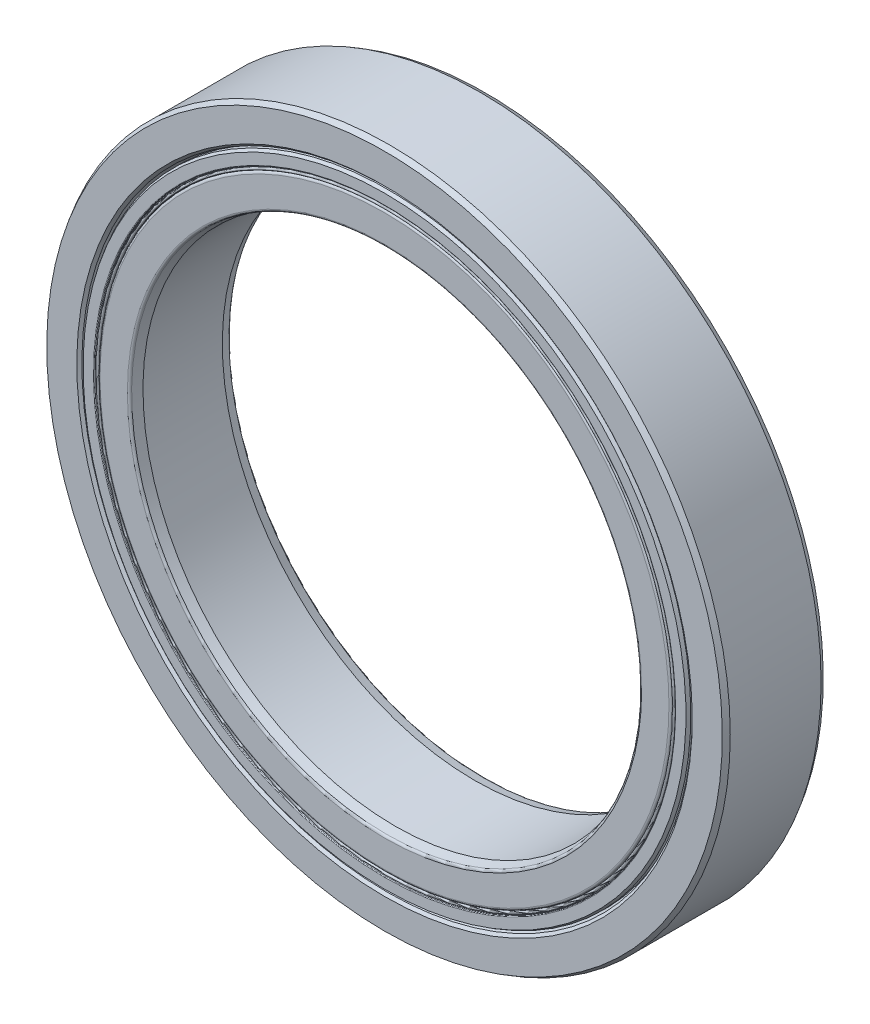
ISO-10303-21;
HEADER;
FILE_DESCRIPTION(('STEP AP214'),'2;1');
FILE_NAME('part.step','',(''),(''),'','','');
FILE_SCHEMA(('AUTOMOTIVE_DESIGN { 1 0 10303 214 1 1 1 1 }'));
ENDSEC;
DATA;
#1=APPLICATION_CONTEXT('core data for automotive mechanical design processes');
#2=APPLICATION_PROTOCOL_DEFINITION('international standard','automotive_design',2000,#1);
#3=PRODUCT_CONTEXT('',#1,'mechanical');
#4=PRODUCT('Part','Part','',(#3));
#5=PRODUCT_RELATED_PRODUCT_CATEGORY('part','',(#4));
#6=PRODUCT_DEFINITION_FORMATION('','',#4);
#7=PRODUCT_DEFINITION_CONTEXT('part definition',#1,'design');
#8=PRODUCT_DEFINITION('design','',#6,#7);
#9=PRODUCT_DEFINITION_SHAPE('','',#8);
#10=(LENGTH_UNIT() NAMED_UNIT(*) SI_UNIT(.MILLI.,.METRE.));
#11=(NAMED_UNIT(*) PLANE_ANGLE_UNIT() SI_UNIT($,.RADIAN.));
#12=(NAMED_UNIT(*) SI_UNIT($,.STERADIAN.) SOLID_ANGLE_UNIT());
#13=UNCERTAINTY_MEASURE_WITH_UNIT(LENGTH_MEASURE(1.E-05),#10,'distance_accuracy_value','');
#14=(GEOMETRIC_REPRESENTATION_CONTEXT(3) GLOBAL_UNCERTAINTY_ASSIGNED_CONTEXT((#13)) GLOBAL_UNIT_ASSIGNED_CONTEXT((#10,
#11,#12)) REPRESENTATION_CONTEXT('',''));
#15=CARTESIAN_POINT('',(0.,0.,0.));
#16=DIRECTION('',(0.,0.,1.));
#17=DIRECTION('',(1.,0.,0.));
#18=AXIS2_PLACEMENT_3D('',#15,#16,#17);
#19=CARTESIAN_POINT('',(0.,11.37,1.3125));
#20=DIRECTION('',(0.,0.,1.));
#21=DIRECTION('',(0.,-1.,0.));
#22=AXIS2_PLACEMENT_3D('',#19,#20,#21);
#23=PLANE('',#22);
#24=CARTESIAN_POINT('',(0.,0.,1.3125));
#25=DIRECTION('',(0.,0.,1.));
#26=DIRECTION('',(0.,-1.,0.));
#27=AXIS2_PLACEMENT_3D('',#24,#25,#26);
#28=CIRCLE('',#27,11.51);
#29=CARTESIAN_POINT('',(0.,-11.51,1.31249999999999));
#30=VERTEX_POINT('',#29);
#31=EDGE_CURVE('E11',#30,#30,#28,.T.);
#32=ORIENTED_EDGE('',*,*,#31,.F.);
#33=EDGE_LOOP('',(#32));
#34=FACE_BOUND('',#33,.T.);
#35=CARTESIAN_POINT('',(0.,0.,1.3125));
#36=DIRECTION('',(0.,0.,1.));
#37=DIRECTION('',(0.,-1.,0.));
#38=AXIS2_PLACEMENT_3D('',#35,#36,#37);
#39=CIRCLE('',#38,11.37);
#40=CARTESIAN_POINT('',(0.,-11.37,1.31249999999999));
#41=VERTEX_POINT('',#40);
#42=EDGE_CURVE('E71',#41,#41,#39,.T.);
#43=ORIENTED_EDGE('',*,*,#42,.T.);
#44=EDGE_LOOP('',(#43));
#45=FACE_BOUND('',#44,.T.);
#46=ADVANCED_FACE('F46',(#34,#45),#23,.F.);
#47=CARTESIAN_POINT('',(0.,0.,2.));
#48=DIRECTION('',(0.,0.,1.));
#49=DIRECTION('',(0.,-1.,0.));
#50=AXIS2_PLACEMENT_3D('',#47,#48,#49);
#51=CYLINDRICAL_SURFACE('',#50,11.51);
#52=CARTESIAN_POINT('',(0.,0.,1.89056210322341));
#53=DIRECTION('',(0.,0.,1.));
#54=DIRECTION('',(0.,-1.,0.));
#55=AXIS2_PLACEMENT_3D('',#52,#53,#54);
#56=CIRCLE('',#55,11.51);
#57=CARTESIAN_POINT('',(0.,-11.51,1.89056210322341));
#58=VERTEX_POINT('',#57);
#59=EDGE_CURVE('E52',#58,#58,#56,.T.);
#60=ORIENTED_EDGE('',*,*,#59,.F.);
#61=EDGE_LOOP('',(#60));
#62=FACE_BOUND('',#61,.T.);
#63=ORIENTED_EDGE('',*,*,#31,.T.);
#64=EDGE_LOOP('',(#63));
#65=FACE_BOUND('',#64,.T.);
#66=ADVANCED_FACE('F102',(#62,#65),#51,.T.);
#67=CARTESIAN_POINT('',(0.,0.,1.89056210322341));
#68=DIRECTION('',(0.,0.,-1.));
#69=DIRECTION('',(0.,1.,0.));
#70=AXIS2_PLACEMENT_3D('',#67,#68,#69);
#71=CONICAL_SURFACE('',#70,11.51,0.174532925199437);
#72=CARTESIAN_POINT('',(0.,0.,1.92503037457884));
#73=DIRECTION('',(0.,0.,1.));
#74=DIRECTION('',(0.,-1.,0.));
#75=AXIS2_PLACEMENT_3D('',#72,#73,#74);
#76=CIRCLE('',#75,11.5039223137817);
#77=CARTESIAN_POINT('',(0.,-11.5039223137817,1.92503037457883));
#78=VERTEX_POINT('',#77);
#79=EDGE_CURVE('E56',#78,#78,#76,.T.);
#80=ORIENTED_EDGE('',*,*,#79,.F.);
#81=EDGE_LOOP('',(#80));
#82=FACE_BOUND('',#81,.T.);
#83=ORIENTED_EDGE('',*,*,#59,.T.);
#84=EDGE_LOOP('',(#83));
#85=FACE_BOUND('',#84,.T.);
#86=ADVANCED_FACE('F97',(#82,#85),#71,.T.);
#87=CARTESIAN_POINT('',(0.,0.,1.9225));
#88=DIRECTION('',(0.,0.,1.));
#89=DIRECTION('',(0.,-1.,0.));
#90=AXIS2_PLACEMENT_3D('',#87,#88,#89);
#91=TOROIDAL_SURFACE('',#90,11.4895718464359,0.0145718464358908);
#92=CARTESIAN_POINT('',(0.,0.,1.9225));
#93=DIRECTION('',(0.,0.,1.));
#94=DIRECTION('',(0.,-1.,0.));
#95=AXIS2_PLACEMENT_3D('',#92,#93,#94);
#96=CIRCLE('',#95,11.475);
#97=CARTESIAN_POINT('',(0.,-11.475,1.9225));
#98=VERTEX_POINT('',#97);
#99=EDGE_CURVE('E60',#98,#98,#96,.T.);
#100=ORIENTED_EDGE('',*,*,#99,.F.);
#101=EDGE_LOOP('',(#100));
#102=FACE_BOUND('',#101,.T.);
#103=ORIENTED_EDGE('',*,*,#79,.T.);
#104=EDGE_LOOP('',(#103));
#105=FACE_BOUND('',#104,.T.);
#106=ADVANCED_FACE('F91',(#102,#105),#91,.T.);
#107=CARTESIAN_POINT('',(0.,0.,2.));
#108=DIRECTION('',(0.,0.,1.));
#109=DIRECTION('',(0.,-1.,0.));
#110=AXIS2_PLACEMENT_3D('',#107,#108,#109);
#111=CYLINDRICAL_SURFACE('',#110,11.475);
#112=CARTESIAN_POINT('',(0.,0.,1.9475));
#113=DIRECTION('',(0.,0.,1.));
#114=DIRECTION('',(0.,-1.,0.));
#115=AXIS2_PLACEMENT_3D('',#112,#113,#114);
#116=CIRCLE('',#115,11.475);
#117=CARTESIAN_POINT('',(0.,-11.475,1.9475));
#118=VERTEX_POINT('',#117);
#119=EDGE_CURVE('E65',#118,#118,#116,.T.);
#120=ORIENTED_EDGE('',*,*,#119,.F.);
#121=EDGE_LOOP('',(#120));
#122=FACE_BOUND('',#121,.T.);
#123=ORIENTED_EDGE('',*,*,#99,.T.);
#124=EDGE_LOOP('',(#123));
#125=FACE_BOUND('',#124,.T.);
#126=ADVANCED_FACE('F85',(#122,#125),#111,.T.);
#127=CARTESIAN_POINT('',(0.,0.,1.9475));
#128=DIRECTION('',(0.,0.,1.));
#129=DIRECTION('',(0.,-1.,0.));
#130=AXIS2_PLACEMENT_3D('',#127,#128,#129);
#131=TOROIDAL_SURFACE('',#130,11.4225,0.0525000000000005);
#132=CARTESIAN_POINT('',(0.,0.,1.9475));
#133=DIRECTION('',(0.,0.,1.));
#134=DIRECTION('',(0.,-1.,0.));
#135=AXIS2_PLACEMENT_3D('',#132,#133,#134);
#136=CIRCLE('',#135,11.37);
#137=CARTESIAN_POINT('',(0.,-11.37,1.9475));
#138=VERTEX_POINT('',#137);
#139=EDGE_CURVE('E68',#138,#138,#136,.T.);
#140=ORIENTED_EDGE('',*,*,#139,.F.);
#141=EDGE_LOOP('',(#140));
#142=FACE_BOUND('',#141,.T.);
#143=ORIENTED_EDGE('',*,*,#119,.T.);
#144=EDGE_LOOP('',(#143));
#145=FACE_BOUND('',#144,.T.);
#146=ADVANCED_FACE('F79',(#142,#145),#131,.T.);
#147=CARTESIAN_POINT('',(0.,0.,2.));
#148=DIRECTION('',(0.,0.,1.));
#149=DIRECTION('',(0.,-1.,0.));
#150=AXIS2_PLACEMENT_3D('',#147,#148,#149);
#151=CYLINDRICAL_SURFACE('',#150,11.37);
#152=ORIENTED_EDGE('',*,*,#42,.F.);
#153=EDGE_LOOP('',(#152));
#154=FACE_BOUND('',#153,.T.);
#155=ORIENTED_EDGE('',*,*,#139,.T.);
#156=EDGE_LOOP('',(#155));
#157=FACE_BOUND('',#156,.T.);
#158=ADVANCED_FACE('F76',(#154,#157),#151,.F.);
#159=CLOSED_SHELL('',(#46,#66,#86,#106,#126,#146,#158));
#160=MANIFOLD_SOLID_BREP('B2',#159);
#161=CARTESIAN_POINT('',(0.,0.,-2.00000000000001));
#162=DIRECTION('',(0.,0.,1.));
#163=DIRECTION('',(0.,-1.,0.));
#164=AXIS2_PLACEMENT_3D('',#161,#162,#163);
#165=CONICAL_SURFACE('',#164,11.945,0.5235987755983);
#166=CARTESIAN_POINT('',(0.,0.,-1.87875644347019));
#167=DIRECTION('',(0.,0.,1.));
#168=DIRECTION('',(0.,-1.,0.));
#169=AXIS2_PLACEMENT_3D('',#166,#167,#168);
#170=CIRCLE('',#169,12.015);
#171=CARTESIAN_POINT('',(0.,-12.015,-1.87875644347019));
#172=VERTEX_POINT('',#171);
#173=EDGE_CURVE('E185',#172,#172,#170,.T.);
#174=ORIENTED_EDGE('',*,*,#173,.F.);
#175=EDGE_LOOP('',(#174));
#176=FACE_BOUND('',#175,.T.);
#177=CARTESIAN_POINT('',(0.,0.,-2.00000000000001));
#178=DIRECTION('',(0.,0.,1.));
#179=DIRECTION('',(0.,-1.,0.));
#180=AXIS2_PLACEMENT_3D('',#177,#178,#179);
#181=CIRCLE('',#180,11.945);
#182=CARTESIAN_POINT('',(0.,-11.945,-2.00000000000001));
#183=VERTEX_POINT('',#182);
#184=EDGE_CURVE('E45',#183,#183,#181,.T.);
#185=ORIENTED_EDGE('',*,*,#184,.T.);
#186=EDGE_LOOP('',(#185));
#187=FACE_BOUND('',#186,.T.);
#188=ADVANCED_FACE('F163',(#176,#187),#165,.T.);
#189=CARTESIAN_POINT('',(0.,11.945,-2.00000000000001));
#190=DIRECTION('',(0.,0.,1.));
#191=DIRECTION('',(0.,-1.,0.));
#192=AXIS2_PLACEMENT_3D('',#189,#190,#191);
#193=PLANE('',#192);
#194=ORIENTED_EDGE('',*,*,#184,.F.);
#195=EDGE_LOOP('',(#194));
#196=FACE_BOUND('',#195,.T.);
#197=CARTESIAN_POINT('',(0.,0.,-2.00000000000001));
#198=DIRECTION('',(0.,0.,1.));
#199=DIRECTION('',(0.,-1.,0.));
#200=AXIS2_PLACEMENT_3D('',#197,#198,#199);
#201=CIRCLE('',#200,11.538);
#202=CARTESIAN_POINT('',(0.,-11.538,-2.00000000000001));
#203=VERTEX_POINT('',#202);
#204=EDGE_CURVE('E169',#203,#203,#201,.T.);
#205=ORIENTED_EDGE('',*,*,#204,.T.);
#206=EDGE_LOOP('',(#205));
#207=FACE_BOUND('',#206,.T.);
#208=ADVANCED_FACE('F192',(#196,#207),#193,.F.);
#209=CARTESIAN_POINT('',(0.,0.,-1.97200000000001));
#210=DIRECTION('',(0.,0.,1.));
#211=DIRECTION('',(0.,-1.,0.));
#212=AXIS2_PLACEMENT_3D('',#209,#210,#211);
#213=TOROIDAL_SURFACE('',#212,11.538,0.028);
#214=ORIENTED_EDGE('',*,*,#204,.F.);
#215=EDGE_LOOP('',(#214));
#216=FACE_BOUND('',#215,.T.);
#217=CARTESIAN_POINT('',(0.,0.,-1.97200000000001));
#218=DIRECTION('',(0.,0.,1.));
#219=DIRECTION('',(0.,-1.,0.));
#220=AXIS2_PLACEMENT_3D('',#217,#218,#219);
#221=CIRCLE('',#220,11.51);
#222=CARTESIAN_POINT('',(0.,-11.51,-1.97200000000001));
#223=VERTEX_POINT('',#222);
#224=EDGE_CURVE('E173',#223,#223,#221,.T.);
#225=ORIENTED_EDGE('',*,*,#224,.T.);
#226=EDGE_LOOP('',(#225));
#227=FACE_BOUND('',#226,.T.);
#228=ADVANCED_FACE('F196',(#216,#227),#213,.T.);
#229=CARTESIAN_POINT('',(0.,0.,2.));
#230=DIRECTION('',(0.,0.,1.));
#231=DIRECTION('',(0.,-1.,0.));
#232=AXIS2_PLACEMENT_3D('',#229,#230,#231);
#233=CYLINDRICAL_SURFACE('',#232,11.51);
#234=ORIENTED_EDGE('',*,*,#224,.F.);
#235=EDGE_LOOP('',(#234));
#236=FACE_BOUND('',#235,.T.);
#237=CARTESIAN_POINT('',(0.,0.,-1.3125));
#238=DIRECTION('',(0.,0.,1.));
#239=DIRECTION('',(0.,-1.,0.));
#240=AXIS2_PLACEMENT_3D('',#237,#238,#239);
#241=CIRCLE('',#240,11.51);
#242=CARTESIAN_POINT('',(0.,-11.51,-1.31250000000001));
#243=VERTEX_POINT('',#242);
#244=EDGE_CURVE('E177',#243,#243,#241,.T.);
#245=ORIENTED_EDGE('',*,*,#244,.T.);
#246=EDGE_LOOP('',(#245));
#247=FACE_BOUND('',#246,.T.);
#248=ADVANCED_FACE('F201',(#236,#247),#233,.F.);
#249=CARTESIAN_POINT('',(0.,12.015,-1.3125));
#250=DIRECTION('',(0.,0.,-1.));
#251=DIRECTION('',(0.,1.,0.));
#252=AXIS2_PLACEMENT_3D('',#249,#250,#251);
#253=PLANE('',#252);
#254=ORIENTED_EDGE('',*,*,#244,.F.);
#255=EDGE_LOOP('',(#254));
#256=FACE_BOUND('',#255,.T.);
#257=CARTESIAN_POINT('',(0.,0.,-1.3125));
#258=DIRECTION('',(0.,0.,1.));
#259=DIRECTION('',(0.,-1.,0.));
#260=AXIS2_PLACEMENT_3D('',#257,#258,#259);
#261=CIRCLE('',#260,12.015);
#262=CARTESIAN_POINT('',(0.,-12.015,-1.31250000000001));
#263=VERTEX_POINT('',#262);
#264=EDGE_CURVE('E182',#263,#263,#261,.T.);
#265=ORIENTED_EDGE('',*,*,#264,.T.);
#266=EDGE_LOOP('',(#265));
#267=FACE_BOUND('',#266,.T.);
#268=ADVANCED_FACE('F207',(#256,#267),#253,.F.);
#269=CARTESIAN_POINT('',(0.,0.,2.));
#270=DIRECTION('',(0.,0.,1.));
#271=DIRECTION('',(0.,-1.,0.));
#272=AXIS2_PLACEMENT_3D('',#269,#270,#271);
#273=CYLINDRICAL_SURFACE('',#272,12.015);
#274=ORIENTED_EDGE('',*,*,#264,.F.);
#275=EDGE_LOOP('',(#274));
#276=FACE_BOUND('',#275,.T.);
#277=ORIENTED_EDGE('',*,*,#173,.T.);
#278=EDGE_LOOP('',(#277));
#279=FACE_BOUND('',#278,.T.);
#280=ADVANCED_FACE('F189',(#276,#279),#273,.T.);
#281=CLOSED_SHELL('',(#188,#208,#228,#248,#268,#280));
#282=MANIFOLD_SOLID_BREP('B6',#281);
#283=CARTESIAN_POINT('',(0.,12.015,1.3125));
#284=DIRECTION('',(0.,0.,1.));
#285=DIRECTION('',(0.,-1.,0.));
#286=AXIS2_PLACEMENT_3D('',#283,#284,#285);
#287=PLANE('',#286);
#288=CARTESIAN_POINT('',(0.,0.,1.3125));
#289=DIRECTION('',(0.,0.,1.));
#290=DIRECTION('',(0.,-1.,0.));
#291=AXIS2_PLACEMENT_3D('',#288,#289,#290);
#292=CIRCLE('',#291,12.015);
#293=CARTESIAN_POINT('',(0.,-12.015,1.31249999999999));
#294=VERTEX_POINT('',#293);
#295=EDGE_CURVE('E162',#294,#294,#292,.T.);
#296=ORIENTED_EDGE('',*,*,#295,.F.);
#297=EDGE_LOOP('',(#296));
#298=FACE_BOUND('',#297,.T.);
#299=CARTESIAN_POINT('',(0.,0.,1.3125));
#300=DIRECTION('',(0.,0.,1.));
#301=DIRECTION('',(0.,-1.,0.));
#302=AXIS2_PLACEMENT_3D('',#299,#300,#301);
#303=CIRCLE('',#302,11.51);
#304=CARTESIAN_POINT('',(0.,-11.51,1.31249999999999));
#305=VERTEX_POINT('',#304);
#306=EDGE_CURVE('E285',#305,#305,#303,.T.);
#307=ORIENTED_EDGE('',*,*,#306,.T.);
#308=EDGE_LOOP('',(#307));
#309=FACE_BOUND('',#308,.T.);
#310=ADVANCED_FACE('F263',(#298,#309),#287,.F.);
#311=CARTESIAN_POINT('',(0.,0.,2.));
#312=DIRECTION('',(0.,0.,1.));
#313=DIRECTION('',(0.,-1.,0.));
#314=AXIS2_PLACEMENT_3D('',#311,#312,#313);
#315=CYLINDRICAL_SURFACE('',#314,12.015);
#316=CARTESIAN_POINT('',(0.,0.,1.87875644347018));
#317=DIRECTION('',(0.,0.,1.));
#318=DIRECTION('',(0.,-1.,0.));
#319=AXIS2_PLACEMENT_3D('',#316,#317,#318);
#320=CIRCLE('',#319,12.015);
#321=CARTESIAN_POINT('',(0.,-12.015,1.87875644347018));
#322=VERTEX_POINT('',#321);
#323=EDGE_CURVE('E269',#322,#322,#320,.T.);
#324=ORIENTED_EDGE('',*,*,#323,.F.);
#325=EDGE_LOOP('',(#324));
#326=FACE_BOUND('',#325,.T.);
#327=ORIENTED_EDGE('',*,*,#295,.T.);
#328=EDGE_LOOP('',(#327));
#329=FACE_BOUND('',#328,.T.);
#330=ADVANCED_FACE('F310',(#326,#329),#315,.T.);
#331=CARTESIAN_POINT('',(0.,0.,1.87875644347018));
#332=DIRECTION('',(0.,0.,-1.));
#333=DIRECTION('',(0.,1.,0.));
#334=AXIS2_PLACEMENT_3D('',#331,#332,#333);
#335=CONICAL_SURFACE('',#334,12.015,0.5235987755983);
#336=CARTESIAN_POINT('',(0.,0.,2.));
#337=DIRECTION('',(0.,0.,1.));
#338=DIRECTION('',(0.,-1.,0.));
#339=AXIS2_PLACEMENT_3D('',#336,#337,#338);
#340=CIRCLE('',#339,11.945);
#341=CARTESIAN_POINT('',(0.,-11.945,2.));
#342=VERTEX_POINT('',#341);
#343=EDGE_CURVE('E273',#342,#342,#340,.T.);
#344=ORIENTED_EDGE('',*,*,#343,.F.);
#345=EDGE_LOOP('',(#344));
#346=FACE_BOUND('',#345,.T.);
#347=ORIENTED_EDGE('',*,*,#323,.T.);
#348=EDGE_LOOP('',(#347));
#349=FACE_BOUND('',#348,.T.);
#350=ADVANCED_FACE('F305',(#346,#349),#335,.T.);
#351=CARTESIAN_POINT('',(0.,11.945,2.));
#352=DIRECTION('',(0.,0.,-1.));
#353=DIRECTION('',(0.,1.,0.));
#354=AXIS2_PLACEMENT_3D('',#351,#352,#353);
#355=PLANE('',#354);
#356=CARTESIAN_POINT('',(0.,0.,2.));
#357=DIRECTION('',(0.,0.,1.));
#358=DIRECTION('',(0.,-1.,0.));
#359=AXIS2_PLACEMENT_3D('',#356,#357,#358);
#360=CIRCLE('',#359,11.538);
#361=CARTESIAN_POINT('',(0.,-11.538,2.));
#362=VERTEX_POINT('',#361);
#363=EDGE_CURVE('E277',#362,#362,#360,.T.);
#364=ORIENTED_EDGE('',*,*,#363,.F.);
#365=EDGE_LOOP('',(#364));
#366=FACE_BOUND('',#365,.T.);
#367=ORIENTED_EDGE('',*,*,#343,.T.);
#368=EDGE_LOOP('',(#367));
#369=FACE_BOUND('',#368,.T.);
#370=ADVANCED_FACE('F299',(#366,#369),#355,.F.);
#371=CARTESIAN_POINT('',(0.,0.,1.972));
#372=DIRECTION('',(0.,0.,1.));
#373=DIRECTION('',(0.,-1.,0.));
#374=AXIS2_PLACEMENT_3D('',#371,#372,#373);
#375=TOROIDAL_SURFACE('',#374,11.538,0.028);
#376=CARTESIAN_POINT('',(0.,0.,1.972));
#377=DIRECTION('',(0.,0.,1.));
#378=DIRECTION('',(0.,-1.,0.));
#379=AXIS2_PLACEMENT_3D('',#376,#377,#378);
#380=CIRCLE('',#379,11.51);
#381=CARTESIAN_POINT('',(0.,-11.51,1.972));
#382=VERTEX_POINT('',#381);
#383=EDGE_CURVE('E282',#382,#382,#380,.T.);
#384=ORIENTED_EDGE('',*,*,#383,.F.);
#385=EDGE_LOOP('',(#384));
#386=FACE_BOUND('',#385,.T.);
#387=ORIENTED_EDGE('',*,*,#363,.T.);
#388=EDGE_LOOP('',(#387));
#389=FACE_BOUND('',#388,.T.);
#390=ADVANCED_FACE('F293',(#386,#389),#375,.T.);
#391=CARTESIAN_POINT('',(0.,0.,2.));
#392=DIRECTION('',(0.,0.,1.));
#393=DIRECTION('',(0.,-1.,0.));
#394=AXIS2_PLACEMENT_3D('',#391,#392,#393);
#395=CYLINDRICAL_SURFACE('',#394,11.51);
#396=ORIENTED_EDGE('',*,*,#306,.F.);
#397=EDGE_LOOP('',(#396));
#398=FACE_BOUND('',#397,.T.);
#399=ORIENTED_EDGE('',*,*,#383,.T.);
#400=EDGE_LOOP('',(#399));
#401=FACE_BOUND('',#400,.T.);
#402=ADVANCED_FACE('F290',(#398,#401),#395,.F.);
#403=CLOSED_SHELL('',(#310,#330,#350,#370,#390,#402));
#404=MANIFOLD_SOLID_BREP('B40',#403);
#405=CARTESIAN_POINT('',(-3.99907052583524,10.9873559685393,0.));
#406=DIRECTION('',(0.,0.,1.));
#407=DIRECTION('',(-0.342020143325657,0.939692620785913,0.));
#408=AXIS2_PLACEMENT_3D('',#405,#406,#407);
#409=SPHERICAL_SURFACE('',#408,1.3125);
#410=CARTESIAN_POINT('',(-3.99907052583524,10.9873559685393,1.3125));
#411=VERTEX_POINT('',#410);
#412=VERTEX_LOOP('',#411);
#413=FACE_BOUND('',#412,.T.);
#414=ADVANCED_FACE('F377',(#413),#409,.T.);
#415=CLOSED_SHELL('',(#414));
#416=MANIFOLD_SOLID_BREP('B157',#415);
#417=CARTESIAN_POINT('',(-7.51579412625975,8.95697465116874,0.));
#418=DIRECTION('',(0.,0.,1.));
#419=DIRECTION('',(-0.64278760968653,0.766044443118986,0.));
#420=AXIS2_PLACEMENT_3D('',#417,#418,#419);
#421=SPHERICAL_SURFACE('',#420,1.3125);
#422=CARTESIAN_POINT('',(-7.51579412625975,8.95697465116874,1.3125));
#423=VERTEX_POINT('',#422);
#424=VERTEX_LOOP('',#423);
#425=FACE_BOUND('',#424,.T.);
#426=ADVANCED_FACE('F398',(#425),#421,.T.);
#427=CLOSED_SHELL('',(#426));
#428=MANIFOLD_SOLID_BREP('B259',#427);
#429=CARTESIAN_POINT('',(-10.1260020337495,5.84625000000012,0.));
#430=DIRECTION('',(0.,0.,1.));
#431=DIRECTION('',(-0.866025403784433,0.50000000000001,0.));
#432=AXIS2_PLACEMENT_3D('',#429,#430,#431);
#433=SPHERICAL_SURFACE('',#432,1.3125);
#434=CARTESIAN_POINT('',(-10.1260020337495,5.84625000000012,1.3125));
#435=VERTEX_POINT('',#434);
#436=VERTEX_LOOP('',#435);
#437=FACE_BOUND('',#436,.T.);
#438=ADVANCED_FACE('F419',(#437),#433,.T.);
#439=CLOSED_SHELL('',(#438));
#440=MANIFOLD_SOLID_BREP('B373',#439);
#441=CARTESIAN_POINT('',(-11.5148646520952,2.0303813173707,0.));
#442=DIRECTION('',(0.,0.,1.));
#443=DIRECTION('',(-0.984807753012206,0.17364817766694,0.));
#444=AXIS2_PLACEMENT_3D('',#441,#442,#443);
#445=SPHERICAL_SURFACE('',#444,1.3125);
#446=CARTESIAN_POINT('',(-11.5148646520952,2.0303813173707,1.3125));
#447=VERTEX_POINT('',#446);
#448=VERTEX_LOOP('',#447);
#449=FACE_BOUND('',#448,.T.);
#450=ADVANCED_FACE('F440',(#449),#445,.T.);
#451=CLOSED_SHELL('',(#450));
#452=MANIFOLD_SOLID_BREP('B394',#451);
#453=CARTESIAN_POINT('',(-11.5148646520953,-2.03038131737047,0.));
#454=DIRECTION('',(0.,0.,1.));
#455=DIRECTION('',(-0.98480775301221,-0.173648177666921,0.));
#456=AXIS2_PLACEMENT_3D('',#453,#454,#455);
#457=SPHERICAL_SURFACE('',#456,1.3125);
#458=CARTESIAN_POINT('',(-11.5148646520953,-2.03038131737047,1.3125));
#459=VERTEX_POINT('',#458);
#460=VERTEX_LOOP('',#459);
#461=FACE_BOUND('',#460,.T.);
#462=ADVANCED_FACE('F461',(#461),#457,.T.);
#463=CLOSED_SHELL('',(#462));
#464=MANIFOLD_SOLID_BREP('B415',#463);
#465=CARTESIAN_POINT('',(-10.1260020337496,-5.84624999999991,0.));
#466=DIRECTION('',(0.,0.,1.));
#467=DIRECTION('',(-0.866025403784443,-0.499999999999992,0.));
#468=AXIS2_PLACEMENT_3D('',#465,#466,#467);
#469=SPHERICAL_SURFACE('',#468,1.3125);
#470=CARTESIAN_POINT('',(-10.1260020337496,-5.84624999999991,1.3125));
#471=VERTEX_POINT('',#470);
#472=VERTEX_LOOP('',#471);
#473=FACE_BOUND('',#472,.T.);
#474=ADVANCED_FACE('F482',(#473),#469,.T.);
#475=CLOSED_SHELL('',(#474));
#476=MANIFOLD_SOLID_BREP('B436',#475);
#477=CARTESIAN_POINT('',(-7.51579412625994,-8.95697465116859,0.));
#478=DIRECTION('',(0.,0.,1.));
#479=DIRECTION('',(-0.642787609686546,-0.766044443118973,0.));
#480=AXIS2_PLACEMENT_3D('',#477,#478,#479);
#481=SPHERICAL_SURFACE('',#480,1.3125);
#482=CARTESIAN_POINT('',(-7.51579412625994,-8.95697465116859,1.3125));
#483=VERTEX_POINT('',#482);
#484=VERTEX_LOOP('',#483);
#485=FACE_BOUND('',#484,.T.);
#486=ADVANCED_FACE('F503',(#485),#481,.T.);
#487=CLOSED_SHELL('',(#486));
#488=MANIFOLD_SOLID_BREP('B457',#487);
#489=CARTESIAN_POINT('',(-3.99907052583546,-10.9873559685392,0.));
#490=DIRECTION('',(0.,0.,1.));
#491=DIRECTION('',(-0.342020143325676,-0.939692620785906,0.));
#492=AXIS2_PLACEMENT_3D('',#489,#490,#491);
#493=SPHERICAL_SURFACE('',#492,1.3125);
#494=CARTESIAN_POINT('',(-3.99907052583546,-10.9873559685392,1.3125));
#495=VERTEX_POINT('',#494);
#496=VERTEX_LOOP('',#495);
#497=FACE_BOUND('',#496,.T.);
#498=ADVANCED_FACE('F524',(#497),#493,.T.);
#499=CLOSED_SHELL('',(#498));
#500=MANIFOLD_SOLID_BREP('B478',#499);
#501=CARTESIAN_POINT('',(0.,-11.6925,0.));
#502=DIRECTION('',(0.,0.,1.));
#503=DIRECTION('',(0.,-1.,0.));
#504=AXIS2_PLACEMENT_3D('',#501,#502,#503);
#505=SPHERICAL_SURFACE('',#504,1.3125);
#506=CARTESIAN_POINT('',(0.,-11.6925,1.3125));
#507=VERTEX_POINT('',#506);
#508=VERTEX_LOOP('',#507);
#509=FACE_BOUND('',#508,.T.);
#510=ADVANCED_FACE('F545',(#509),#505,.T.);
#511=CLOSED_SHELL('',(#510));
#512=MANIFOLD_SOLID_BREP('B499',#511);
#513=CARTESIAN_POINT('',(3.99907052583532,-10.9873559685393,0.));
#514=DIRECTION('',(0.,0.,1.));
#515=DIRECTION('',(0.342020143325663,-0.939692620785911,0.));
#516=AXIS2_PLACEMENT_3D('',#513,#514,#515);
#517=SPHERICAL_SURFACE('',#516,1.3125);
#518=CARTESIAN_POINT('',(3.99907052583532,-10.9873559685393,1.3125));
#519=VERTEX_POINT('',#518);
#520=VERTEX_LOOP('',#519);
#521=FACE_BOUND('',#520,.T.);
#522=ADVANCED_FACE('F566',(#521),#517,.T.);
#523=CLOSED_SHELL('',(#522));
#524=MANIFOLD_SOLID_BREP('B520',#523);
#525=CARTESIAN_POINT('',(7.51579412625982,-8.95697465116869,0.));
#526=DIRECTION('',(0.,0.,1.));
#527=DIRECTION('',(0.642787609686535,-0.766044443118981,0.));
#528=AXIS2_PLACEMENT_3D('',#525,#526,#527);
#529=SPHERICAL_SURFACE('',#528,1.3125);
#530=CARTESIAN_POINT('',(7.51579412625982,-8.95697465116869,1.3125));
#531=VERTEX_POINT('',#530);
#532=VERTEX_LOOP('',#531);
#533=FACE_BOUND('',#532,.T.);
#534=ADVANCED_FACE('F587',(#533),#529,.T.);
#535=CLOSED_SHELL('',(#534));
#536=MANIFOLD_SOLID_BREP('B541',#535);
#537=CARTESIAN_POINT('',(10.1260020337495,-5.84625000000005,0.));
#538=DIRECTION('',(0.,0.,1.));
#539=DIRECTION('',(0.866025403784436,-0.500000000000004,0.));
#540=AXIS2_PLACEMENT_3D('',#537,#538,#539);
#541=SPHERICAL_SURFACE('',#540,1.3125);
#542=CARTESIAN_POINT('',(10.1260020337495,-5.84625000000005,1.3125));
#543=VERTEX_POINT('',#542);
#544=VERTEX_LOOP('',#543);
#545=FACE_BOUND('',#544,.T.);
#546=ADVANCED_FACE('F608',(#545),#541,.T.);
#547=CLOSED_SHELL('',(#546));
#548=MANIFOLD_SOLID_BREP('B562',#547);
#549=CARTESIAN_POINT('',(11.5148646520952,-2.03038131737063,0.));
#550=DIRECTION('',(0.,0.,1.));
#551=DIRECTION('',(0.984807753012207,-0.173648177666934,0.));
#552=AXIS2_PLACEMENT_3D('',#549,#550,#551);
#553=SPHERICAL_SURFACE('',#552,1.3125);
#554=CARTESIAN_POINT('',(11.5148646520952,-2.03038131737063,1.3125));
#555=VERTEX_POINT('',#554);
#556=VERTEX_LOOP('',#555);
#557=FACE_BOUND('',#556,.T.);
#558=ADVANCED_FACE('F629',(#557),#553,.T.);
#559=CLOSED_SHELL('',(#558));
#560=MANIFOLD_SOLID_BREP('B583',#559);
#561=CARTESIAN_POINT('',(11.5148646520953,2.03038131737055,0.));
#562=DIRECTION('',(0.,0.,1.));
#563=DIRECTION('',(0.984807753012209,0.173648177666927,0.));
#564=AXIS2_PLACEMENT_3D('',#561,#562,#563);
#565=SPHERICAL_SURFACE('',#564,1.3125);
#566=CARTESIAN_POINT('',(11.5148646520953,2.03038131737055,1.3125));
#567=VERTEX_POINT('',#566);
#568=VERTEX_LOOP('',#567);
#569=FACE_BOUND('',#568,.T.);
#570=ADVANCED_FACE('F650',(#569),#565,.T.);
#571=CLOSED_SHELL('',(#570));
#572=MANIFOLD_SOLID_BREP('B604',#571);
#573=CARTESIAN_POINT('',(10.1260020337496,5.84624999999998,0.));
#574=DIRECTION('',(0.,0.,1.));
#575=DIRECTION('',(0.86602540378444,0.499999999999998,0.));
#576=AXIS2_PLACEMENT_3D('',#573,#574,#575);
#577=SPHERICAL_SURFACE('',#576,1.3125);
#578=CARTESIAN_POINT('',(10.1260020337496,5.84624999999998,1.3125));
#579=VERTEX_POINT('',#578);
#580=VERTEX_LOOP('',#579);
#581=FACE_BOUND('',#580,.T.);
#582=ADVANCED_FACE('F671',(#581),#577,.T.);
#583=CLOSED_SHELL('',(#582));
#584=MANIFOLD_SOLID_BREP('B625',#583);
#585=CARTESIAN_POINT('',(7.51579412625988,8.95697465116864,0.));
#586=DIRECTION('',(0.,0.,1.));
#587=DIRECTION('',(0.642787609686541,0.766044443118977,0.));
#588=AXIS2_PLACEMENT_3D('',#585,#586,#587);
#589=SPHERICAL_SURFACE('',#588,1.3125);
#590=CARTESIAN_POINT('',(7.51579412625988,8.95697465116864,1.3125));
#591=VERTEX_POINT('',#590);
#592=VERTEX_LOOP('',#591);
#593=FACE_BOUND('',#592,.T.);
#594=ADVANCED_FACE('F692',(#593),#589,.T.);
#595=CLOSED_SHELL('',(#594));
#596=MANIFOLD_SOLID_BREP('B646',#595);
#597=CARTESIAN_POINT('',(3.99907052583539,10.9873559685392,0.));
#598=DIRECTION('',(0.,0.,1.));
#599=DIRECTION('',(0.342020143325669,0.939692620785908,0.));
#600=AXIS2_PLACEMENT_3D('',#597,#598,#599);
#601=SPHERICAL_SURFACE('',#600,1.3125);
#602=CARTESIAN_POINT('',(3.99907052583539,10.9873559685392,1.3125));
#603=VERTEX_POINT('',#602);
#604=VERTEX_LOOP('',#603);
#605=FACE_BOUND('',#604,.T.);
#606=ADVANCED_FACE('F713',(#605),#601,.T.);
#607=CLOSED_SHELL('',(#606));
#608=MANIFOLD_SOLID_BREP('B667',#607);
#609=CARTESIAN_POINT('',(0.,11.6925,0.));
#610=DIRECTION('',(0.,0.,1.));
#611=DIRECTION('',(0.,1.,0.));
#612=AXIS2_PLACEMENT_3D('',#609,#610,#611);
#613=SPHERICAL_SURFACE('',#612,1.3125);
#614=CARTESIAN_POINT('',(0.,11.6925,1.3125));
#615=VERTEX_POINT('',#614);
#616=VERTEX_LOOP('',#615);
#617=FACE_BOUND('',#616,.T.);
#618=ADVANCED_FACE('F736',(#617),#613,.T.);
#619=CLOSED_SHELL('',(#618));
#620=MANIFOLD_SOLID_BREP('B688',#619);
#621=CARTESIAN_POINT('',(0.,0.,-1.90164876286105));
#622=DIRECTION('',(0.,0.,1.));
#623=DIRECTION('',(0.,-1.,0.));
#624=AXIS2_PLACEMENT_3D('',#621,#622,#623);
#625=TOROIDAL_SURFACE('',#624,10.19,0.0983512371389572);
#626=CARTESIAN_POINT('',(0.,0.,-2.00000000000001));
#627=DIRECTION('',(0.,0.,1.));
#628=DIRECTION('',(0.,-1.,0.));
#629=AXIS2_PLACEMENT_3D('',#626,#627,#628);
#630=CIRCLE('',#629,10.19);
#631=CARTESIAN_POINT('',(0.,-10.19,-2.00000000000001));
#632=VERTEX_POINT('',#631);
#633=EDGE_CURVE('E735',#632,#632,#630,.T.);
#634=ORIENTED_EDGE('',*,*,#633,.F.);
#635=EDGE_LOOP('',(#634));
#636=FACE_BOUND('',#635,.T.);
#637=CARTESIAN_POINT('',(0.,0.,-1.92710393614201));
#638=DIRECTION('',(0.,0.,1.));
#639=DIRECTION('',(0.,-1.,0.));
#640=AXIS2_PLACEMENT_3D('',#637,#638,#639);
#641=CIRCLE('',#640,10.095);
#642=CARTESIAN_POINT('',(0.,-10.095,-1.92710393614201));
#643=VERTEX_POINT('',#642);
#644=EDGE_CURVE('E798',#643,#643,#641,.T.);
#645=ORIENTED_EDGE('',*,*,#644,.T.);
#646=EDGE_LOOP('',(#645));
#647=FACE_BOUND('',#646,.T.);
#648=ADVANCED_FACE('F758',(#636,#647),#625,.T.);
#649=CARTESIAN_POINT('',(0.,10.19,-2.));
#650=DIRECTION('',(0.,0.,1.));
#651=DIRECTION('',(0.,-1.,0.));
#652=AXIS2_PLACEMENT_3D('',#649,#650,#651);
#653=PLANE('',#652);
#654=CARTESIAN_POINT('',(0.,0.,-2.00000000000001));
#655=DIRECTION('',(0.,0.,1.));
#656=DIRECTION('',(0.,-1.,0.));
#657=AXIS2_PLACEMENT_3D('',#654,#655,#656);
#658=CIRCLE('',#657,11.2716487628611);
#659=CARTESIAN_POINT('',(0.,-11.2716487628611,-2.00000000000001));
#660=VERTEX_POINT('',#659);
#661=EDGE_CURVE('E764',#660,#660,#658,.T.);
#662=ORIENTED_EDGE('',*,*,#661,.F.);
#663=EDGE_LOOP('',(#662));
#664=FACE_BOUND('',#663,.T.);
#665=ORIENTED_EDGE('',*,*,#633,.T.);
#666=EDGE_LOOP('',(#665));
#667=FACE_BOUND('',#666,.T.);
#668=ADVANCED_FACE('F859',(#664,#667),#653,.F.);
#669=CARTESIAN_POINT('',(0.,0.,-1.90164876286105));
#670=DIRECTION('',(0.,0.,1.));
#671=DIRECTION('',(0.,-1.,0.));
#672=AXIS2_PLACEMENT_3D('',#669,#670,#671);
#673=TOROIDAL_SURFACE('',#672,11.2716487628611,0.0983512371389565);
#674=CARTESIAN_POINT('',(0.,0.,-1.90164876286105));
#675=DIRECTION('',(0.,0.,1.));
#676=DIRECTION('',(0.,-1.,0.));
#677=AXIS2_PLACEMENT_3D('',#674,#675,#676);
#678=CIRCLE('',#677,11.37);
#679=CARTESIAN_POINT('',(0.,-11.37,-1.90164876286105));
#680=VERTEX_POINT('',#679);
#681=EDGE_CURVE('E768',#680,#680,#678,.T.);
#682=ORIENTED_EDGE('',*,*,#681,.F.);
#683=EDGE_LOOP('',(#682));
#684=FACE_BOUND('',#683,.T.);
#685=ORIENTED_EDGE('',*,*,#661,.T.);
#686=EDGE_LOOP('',(#685));
#687=FACE_BOUND('',#686,.T.);
#688=ADVANCED_FACE('F854',(#684,#687),#673,.T.);
#689=CARTESIAN_POINT('',(0.,0.,2.));
#690=DIRECTION('',(0.,0.,1.));
#691=DIRECTION('',(0.,-1.,0.));
#692=AXIS2_PLACEMENT_3D('',#689,#690,#691);
#693=CYLINDRICAL_SURFACE('',#692,11.37);
#694=CARTESIAN_POINT('',(0.,0.,-1.27226176551841));
#695=DIRECTION('',(0.,0.,1.));
#696=DIRECTION('',(0.,-1.,0.));
#697=AXIS2_PLACEMENT_3D('',#694,#695,#696);
#698=CIRCLE('',#697,11.37);
#699=CARTESIAN_POINT('',(0.,-11.37,-1.27226176551841));
#700=VERTEX_POINT('',#699);
#701=EDGE_CURVE('E772',#700,#700,#698,.T.);
#702=ORIENTED_EDGE('',*,*,#701,.F.);
#703=EDGE_LOOP('',(#702));
#704=FACE_BOUND('',#703,.T.);
#705=ORIENTED_EDGE('',*,*,#681,.T.);
#706=EDGE_LOOP('',(#705));
#707=FACE_BOUND('',#706,.T.);
#708=ADVANCED_FACE('F848',(#704,#707),#693,.T.);
#709=CARTESIAN_POINT('',(0.,0.,0.));
#710=DIRECTION('',(0.,0.,1.));
#711=DIRECTION('',(0.,-1.,0.));
#712=AXIS2_PLACEMENT_3D('',#709,#710,#711);
#713=TOROIDAL_SURFACE('',#712,11.6925,1.3125);
#714=CARTESIAN_POINT('',(0.,0.,1.2722617655184));
#715=DIRECTION('',(0.,0.,1.));
#716=DIRECTION('',(0.,-1.,0.));
#717=AXIS2_PLACEMENT_3D('',#714,#715,#716);
#718=CIRCLE('',#717,11.37);
#719=CARTESIAN_POINT('',(0.,-11.37,1.2722617655184));
#720=VERTEX_POINT('',#719);
#721=EDGE_CURVE('E777',#720,#720,#718,.T.);
#722=ORIENTED_EDGE('',*,*,#721,.F.);
#723=EDGE_LOOP('',(#722));
#724=FACE_BOUND('',#723,.T.);
#725=ORIENTED_EDGE('',*,*,#701,.T.);
#726=EDGE_LOOP('',(#725));
#727=FACE_BOUND('',#726,.T.);
#728=ADVANCED_FACE('F842',(#724,#727),#713,.F.);
#729=CARTESIAN_POINT('',(0.,0.,2.));
#730=DIRECTION('',(0.,0.,1.));
#731=DIRECTION('',(0.,-1.,0.));
#732=AXIS2_PLACEMENT_3D('',#729,#730,#731);
#733=CYLINDRICAL_SURFACE('',#732,11.37);
#734=CARTESIAN_POINT('',(0.,0.,1.90164876286105));
#735=DIRECTION('',(0.,0.,1.));
#736=DIRECTION('',(0.,-1.,0.));
#737=AXIS2_PLACEMENT_3D('',#734,#735,#736);
#738=CIRCLE('',#737,11.37);
#739=CARTESIAN_POINT('',(0.,-11.37,1.90164876286104));
#740=VERTEX_POINT('',#739);
#741=EDGE_CURVE('E780',#740,#740,#738,.T.);
#742=ORIENTED_EDGE('',*,*,#741,.F.);
#743=EDGE_LOOP('',(#742));
#744=FACE_BOUND('',#743,.T.);
#745=ORIENTED_EDGE('',*,*,#721,.T.);
#746=EDGE_LOOP('',(#745));
#747=FACE_BOUND('',#746,.T.);
#748=ADVANCED_FACE('F836',(#744,#747),#733,.T.);
#749=CARTESIAN_POINT('',(0.,0.,1.90164876286105));
#750=DIRECTION('',(0.,0.,1.));
#751=DIRECTION('',(0.,-1.,0.));
#752=AXIS2_PLACEMENT_3D('',#749,#750,#751);
#753=TOROIDAL_SURFACE('',#752,11.2716487628611,0.0983512371389565);
#754=CARTESIAN_POINT('',(0.,0.,2.));
#755=DIRECTION('',(0.,0.,1.));
#756=DIRECTION('',(0.,-1.,0.));
#757=AXIS2_PLACEMENT_3D('',#754,#755,#756);
#758=CIRCLE('',#757,11.2716487628611);
#759=CARTESIAN_POINT('',(0.,-11.2716487628611,2.));
#760=VERTEX_POINT('',#759);
#761=EDGE_CURVE('E783',#760,#760,#758,.T.);
#762=ORIENTED_EDGE('',*,*,#761,.F.);
#763=EDGE_LOOP('',(#762));
#764=FACE_BOUND('',#763,.T.);
#765=ORIENTED_EDGE('',*,*,#741,.T.);
#766=EDGE_LOOP('',(#765));
#767=FACE_BOUND('',#766,.T.);
#768=ADVANCED_FACE('F830',(#764,#767),#753,.T.);
#769=CARTESIAN_POINT('',(0.,10.19,2.));
#770=DIRECTION('',(0.,0.,-1.));
#771=DIRECTION('',(0.,1.,0.));
#772=AXIS2_PLACEMENT_3D('',#769,#770,#771);
#773=PLANE('',#772);
#774=CARTESIAN_POINT('',(0.,0.,2.));
#775=DIRECTION('',(0.,0.,1.));
#776=DIRECTION('',(0.,-1.,0.));
#777=AXIS2_PLACEMENT_3D('',#774,#775,#776);
#778=CIRCLE('',#777,10.19);
#779=CARTESIAN_POINT('',(0.,-10.19,2.));
#780=VERTEX_POINT('',#779);
#781=EDGE_CURVE('E786',#780,#780,#778,.T.);
#782=ORIENTED_EDGE('',*,*,#781,.F.);
#783=EDGE_LOOP('',(#782));
#784=FACE_BOUND('',#783,.T.);
#785=ORIENTED_EDGE('',*,*,#761,.T.);
#786=EDGE_LOOP('',(#785));
#787=FACE_BOUND('',#786,.T.);
#788=ADVANCED_FACE('F824',(#784,#787),#773,.F.);
#789=CARTESIAN_POINT('',(0.,0.,1.90164876286105));
#790=DIRECTION('',(0.,0.,1.));
#791=DIRECTION('',(0.,-1.,0.));
#792=AXIS2_PLACEMENT_3D('',#789,#790,#791);
#793=TOROIDAL_SURFACE('',#792,10.19,0.098351237138958);
#794=CARTESIAN_POINT('',(0.,0.,1.927103936142));
#795=DIRECTION('',(0.,0.,1.));
#796=DIRECTION('',(0.,-1.,0.));
#797=AXIS2_PLACEMENT_3D('',#794,#795,#796);
#798=CIRCLE('',#797,10.095);
#799=CARTESIAN_POINT('',(0.,-10.095,1.927103936142));
#800=VERTEX_POINT('',#799);
#801=EDGE_CURVE('E789',#800,#800,#798,.T.);
#802=ORIENTED_EDGE('',*,*,#801,.F.);
#803=EDGE_LOOP('',(#802));
#804=FACE_BOUND('',#803,.T.);
#805=ORIENTED_EDGE('',*,*,#781,.T.);
#806=EDGE_LOOP('',(#805));
#807=FACE_BOUND('',#806,.T.);
#808=ADVANCED_FACE('F818',(#804,#807),#793,.T.);
#809=CARTESIAN_POINT('',(0.,0.,1.927103936142));
#810=DIRECTION('',(0.,0.,1.));
#811=DIRECTION('',(0.,-1.,0.));
#812=AXIS2_PLACEMENT_3D('',#809,#810,#811);
#813=CONICAL_SURFACE('',#812,10.095,0.261799387799152);
#814=CARTESIAN_POINT('',(0.,0.,1.57255910942296));
#815=DIRECTION('',(0.,0.,1.));
#816=DIRECTION('',(0.,-1.,0.));
#817=AXIS2_PLACEMENT_3D('',#814,#815,#816);
#818=CIRCLE('',#817,10.);
#819=CARTESIAN_POINT('',(0.,-10.,1.57255910942296));
#820=VERTEX_POINT('',#819);
#821=EDGE_CURVE('E792',#820,#820,#818,.T.);
#822=ORIENTED_EDGE('',*,*,#821,.F.);
#823=EDGE_LOOP('',(#822));
#824=FACE_BOUND('',#823,.T.);
#825=ORIENTED_EDGE('',*,*,#801,.T.);
#826=EDGE_LOOP('',(#825));
#827=FACE_BOUND('',#826,.T.);
#828=ADVANCED_FACE('F812',(#824,#827),#813,.F.);
#829=CARTESIAN_POINT('',(0.,0.,2.));
#830=DIRECTION('',(0.,0.,1.));
#831=DIRECTION('',(0.,-1.,0.));
#832=AXIS2_PLACEMENT_3D('',#829,#830,#831);
#833=CYLINDRICAL_SURFACE('',#832,10.);
#834=CARTESIAN_POINT('',(0.,0.,-1.57255910942297));
#835=DIRECTION('',(0.,0.,1.));
#836=DIRECTION('',(0.,-1.,0.));
#837=AXIS2_PLACEMENT_3D('',#834,#835,#836);
#838=CIRCLE('',#837,10.);
#839=CARTESIAN_POINT('',(0.,-10.,-1.57255910942297));
#840=VERTEX_POINT('',#839);
#841=EDGE_CURVE('E795',#840,#840,#838,.T.);
#842=ORIENTED_EDGE('',*,*,#841,.F.);
#843=EDGE_LOOP('',(#842));
#844=FACE_BOUND('',#843,.T.);
#845=ORIENTED_EDGE('',*,*,#821,.T.);
#846=EDGE_LOOP('',(#845));
#847=FACE_BOUND('',#846,.T.);
#848=ADVANCED_FACE('F806',(#844,#847),#833,.F.);
#849=CARTESIAN_POINT('',(0.,0.,-1.57255910942297));
#850=DIRECTION('',(0.,0.,-1.));
#851=DIRECTION('',(0.,1.,0.));
#852=AXIS2_PLACEMENT_3D('',#849,#850,#851);
#853=CONICAL_SURFACE('',#852,10.,0.261799387799153);
#854=ORIENTED_EDGE('',*,*,#644,.F.);
#855=EDGE_LOOP('',(#854));
#856=FACE_BOUND('',#855,.T.);
#857=ORIENTED_EDGE('',*,*,#841,.T.);
#858=EDGE_LOOP('',(#857));
#859=FACE_BOUND('',#858,.T.);
#860=ADVANCED_FACE('F803',(#856,#859),#853,.F.);
#861=CLOSED_SHELL('',(#648,#668,#688,#708,#728,#748,#768,#788,#808,#828,#848,#860));
#862=MANIFOLD_SOLID_BREP('B709',#861);
#863=CARTESIAN_POINT('',(0.,0.,2.));
#864=DIRECTION('',(0.,0.,1.));
#865=DIRECTION('',(0.,-1.,0.));
#866=AXIS2_PLACEMENT_3D('',#863,#864,#865);
#867=CYLINDRICAL_SURFACE('',#866,12.015);
#868=CARTESIAN_POINT('',(0.,0.,1.2722617655184));
#869=DIRECTION('',(0.,0.,1.));
#870=DIRECTION('',(0.,-1.,0.));
#871=AXIS2_PLACEMENT_3D('',#868,#869,#870);
#872=CIRCLE('',#871,12.015);
#873=CARTESIAN_POINT('',(0.,-12.015,1.2722617655184));
#874=VERTEX_POINT('',#873);
#875=EDGE_CURVE('E757',#874,#874,#872,.T.);
#876=ORIENTED_EDGE('',*,*,#875,.F.);
#877=EDGE_LOOP('',(#876));
#878=FACE_BOUND('',#877,.T.);
#879=CARTESIAN_POINT('',(0.,0.,1.6829872849735));
#880=DIRECTION('',(0.,0.,1.));
#881=DIRECTION('',(0.,-1.,0.));
#882=AXIS2_PLACEMENT_3D('',#879,#880,#881);
#883=CIRCLE('',#882,12.015);
#884=CARTESIAN_POINT('',(0.,-12.015,1.6829872849735));
#885=VERTEX_POINT('',#884);
#886=EDGE_CURVE('E982',#885,#885,#883,.T.);
#887=ORIENTED_EDGE('',*,*,#886,.T.);
#888=EDGE_LOOP('',(#887));
#889=FACE_BOUND('',#888,.T.);
#890=ADVANCED_FACE('F942',(#878,#889),#867,.F.);
#891=CARTESIAN_POINT('',(0.,0.,0.));
#892=DIRECTION('',(0.,0.,1.));
#893=DIRECTION('',(0.,-1.,0.));
#894=AXIS2_PLACEMENT_3D('',#891,#892,#893);
#895=TOROIDAL_SURFACE('',#894,11.6925,1.3125);
#896=CARTESIAN_POINT('',(0.,0.,-1.27226176551841));
#897=DIRECTION('',(0.,0.,1.));
#898=DIRECTION('',(0.,-1.,0.));
#899=AXIS2_PLACEMENT_3D('',#896,#897,#898);
#900=CIRCLE('',#899,12.015);
#901=CARTESIAN_POINT('',(0.,-12.015,-1.27226176551841));
#902=VERTEX_POINT('',#901);
#903=EDGE_CURVE('E948',#902,#902,#900,.T.);
#904=ORIENTED_EDGE('',*,*,#903,.F.);
#905=EDGE_LOOP('',(#904));
#906=FACE_BOUND('',#905,.T.);
#907=ORIENTED_EDGE('',*,*,#875,.T.);
#908=EDGE_LOOP('',(#907));
#909=FACE_BOUND('',#908,.T.);
#910=ADVANCED_FACE('F1043',(#906,#909),#895,.F.);
#911=CARTESIAN_POINT('',(0.,0.,2.));
#912=DIRECTION('',(0.,0.,1.));
#913=DIRECTION('',(0.,-1.,0.));
#914=AXIS2_PLACEMENT_3D('',#911,#912,#913);
#915=CYLINDRICAL_SURFACE('',#914,12.015);
#916=CARTESIAN_POINT('',(0.,0.,-1.68298728497351));
#917=DIRECTION('',(0.,0.,1.));
#918=DIRECTION('',(0.,-1.,0.));
#919=AXIS2_PLACEMENT_3D('',#916,#917,#918);
#920=CIRCLE('',#919,12.015);
#921=CARTESIAN_POINT('',(0.,-12.015,-1.68298728497351));
#922=VERTEX_POINT('',#921);
#923=EDGE_CURVE('E952',#922,#922,#920,.T.);
#924=ORIENTED_EDGE('',*,*,#923,.F.);
#925=EDGE_LOOP('',(#924));
#926=FACE_BOUND('',#925,.T.);
#927=ORIENTED_EDGE('',*,*,#903,.T.);
#928=EDGE_LOOP('',(#927));
#929=FACE_BOUND('',#928,.T.);
#930=ADVANCED_FACE('F1038',(#926,#929),#915,.F.);
#931=CARTESIAN_POINT('',(0.,0.,-1.68298728497351));
#932=DIRECTION('',(0.,0.,-1.));
#933=DIRECTION('',(0.,1.,0.));
#934=AXIS2_PLACEMENT_3D('',#931,#932,#933);
#935=CONICAL_SURFACE('',#934,12.015,0.349065850398861);
#936=CARTESIAN_POINT('',(0.,0.,-1.90000000000001));
#937=DIRECTION('',(0.,0.,1.));
#938=DIRECTION('',(0.,-1.,0.));
#939=AXIS2_PLACEMENT_3D('',#936,#937,#938);
#940=CIRCLE('',#939,12.0939861687269);
#941=CARTESIAN_POINT('',(0.,-12.0939861687269,-1.90000000000001));
#942=VERTEX_POINT('',#941);
#943=EDGE_CURVE('E956',#942,#942,#940,.T.);
#944=ORIENTED_EDGE('',*,*,#943,.F.);
#945=EDGE_LOOP('',(#944));
#946=FACE_BOUND('',#945,.T.);
#947=ORIENTED_EDGE('',*,*,#923,.T.);
#948=EDGE_LOOP('',(#947));
#949=FACE_BOUND('',#948,.T.);
#950=ADVANCED_FACE('F1032',(#946,#949),#935,.F.);
#951=CARTESIAN_POINT('',(0.,0.,-1.90000000000001));
#952=DIRECTION('',(0.,0.,-1.));
#953=DIRECTION('',(0.,1.,0.));
#954=AXIS2_PLACEMENT_3D('',#951,#952,#953);
#955=CONICAL_SURFACE('',#954,12.0939861687269,0.785398163397433);
#956=CARTESIAN_POINT('',(0.,0.,-2.00000000000001));
#957=DIRECTION('',(0.,0.,1.));
#958=DIRECTION('',(0.,-1.,0.));
#959=AXIS2_PLACEMENT_3D('',#956,#957,#958);
#960=CIRCLE('',#959,12.1939861687269);
#961=CARTESIAN_POINT('',(0.,-12.1939861687269,-2.00000000000001));
#962=VERTEX_POINT('',#961);
#963=EDGE_CURVE('E961',#962,#962,#960,.T.);
#964=ORIENTED_EDGE('',*,*,#963,.F.);
#965=EDGE_LOOP('',(#964));
#966=FACE_BOUND('',#965,.T.);
#967=ORIENTED_EDGE('',*,*,#943,.T.);
#968=EDGE_LOOP('',(#967));
#969=FACE_BOUND('',#968,.T.);
#970=ADVANCED_FACE('F1026',(#966,#969),#955,.F.);
#971=CARTESIAN_POINT('',(0.,13.3845299461621,-2.));
#972=DIRECTION('',(0.,0.,1.));
#973=DIRECTION('',(0.,-1.,0.));
#974=AXIS2_PLACEMENT_3D('',#971,#972,#973);
#975=PLANE('',#974);
#976=CARTESIAN_POINT('',(0.,0.,-2.00000000000001));
#977=DIRECTION('',(0.,0.,1.));
#978=DIRECTION('',(0.,-1.,0.));
#979=AXIS2_PLACEMENT_3D('',#976,#977,#978);
#980=CIRCLE('',#979,13.3845299461621);
#981=CARTESIAN_POINT('',(0.,-13.3845299461621,-2.00000000000001));
#982=VERTEX_POINT('',#981);
#983=EDGE_CURVE('E964',#982,#982,#980,.T.);
#984=ORIENTED_EDGE('',*,*,#983,.F.);
#985=EDGE_LOOP('',(#984));
#986=FACE_BOUND('',#985,.T.);
#987=ORIENTED_EDGE('',*,*,#963,.T.);
#988=EDGE_LOOP('',(#987));
#989=FACE_BOUND('',#988,.T.);
#990=ADVANCED_FACE('F1020',(#986,#989),#975,.F.);
#991=CARTESIAN_POINT('',(0.,0.,-2.00000000000001));
#992=DIRECTION('',(0.,0.,1.));
#993=DIRECTION('',(0.,-1.,0.));
#994=AXIS2_PLACEMENT_3D('',#991,#992,#993);
#995=CONICAL_SURFACE('',#994,13.3845299461621,0.523598775598293);
#996=CARTESIAN_POINT('',(0.,0.,-1.80000000000001));
#997=DIRECTION('',(0.,0.,1.));
#998=DIRECTION('',(0.,-1.,0.));
#999=AXIS2_PLACEMENT_3D('',#996,#997,#998);
#1000=CIRCLE('',#999,13.5);
#1001=CARTESIAN_POINT('',(0.,-13.5,-1.80000000000001));
#1002=VERTEX_POINT('',#1001);
#1003=EDGE_CURVE('E967',#1002,#1002,#1000,.T.);
#1004=ORIENTED_EDGE('',*,*,#1003,.F.);
#1005=EDGE_LOOP('',(#1004));
#1006=FACE_BOUND('',#1005,.T.);
#1007=ORIENTED_EDGE('',*,*,#983,.T.);
#1008=EDGE_LOOP('',(#1007));
#1009=FACE_BOUND('',#1008,.T.);
#1010=ADVANCED_FACE('F1014',(#1006,#1009),#995,.T.);
#1011=CARTESIAN_POINT('',(0.,0.,2.));
#1012=DIRECTION('',(0.,0.,1.));
#1013=DIRECTION('',(0.,-1.,0.));
#1014=AXIS2_PLACEMENT_3D('',#1011,#1012,#1013);
#1015=CYLINDRICAL_SURFACE('',#1014,13.5);
#1016=CARTESIAN_POINT('',(0.,0.,1.8));
#1017=DIRECTION('',(0.,0.,1.));
#1018=DIRECTION('',(0.,-1.,0.));
#1019=AXIS2_PLACEMENT_3D('',#1016,#1017,#1018);
#1020=CIRCLE('',#1019,13.5);
#1021=CARTESIAN_POINT('',(0.,-13.5,1.8));
#1022=VERTEX_POINT('',#1021);
#1023=EDGE_CURVE('E970',#1022,#1022,#1020,.T.);
#1024=ORIENTED_EDGE('',*,*,#1023,.F.);
#1025=EDGE_LOOP('',(#1024));
#1026=FACE_BOUND('',#1025,.T.);
#1027=ORIENTED_EDGE('',*,*,#1003,.T.);
#1028=EDGE_LOOP('',(#1027));
#1029=FACE_BOUND('',#1028,.T.);
#1030=ADVANCED_FACE('F1008',(#1026,#1029),#1015,.T.);
#1031=CARTESIAN_POINT('',(0.,0.,1.8));
#1032=DIRECTION('',(0.,0.,-1.));
#1033=DIRECTION('',(0.,1.,0.));
#1034=AXIS2_PLACEMENT_3D('',#1031,#1032,#1033);
#1035=CONICAL_SURFACE('',#1034,13.5,0.523598775598293);
#1036=CARTESIAN_POINT('',(0.,0.,2.));
#1037=DIRECTION('',(0.,0.,1.));
#1038=DIRECTION('',(0.,-1.,0.));
#1039=AXIS2_PLACEMENT_3D('',#1036,#1037,#1038);
#1040=CIRCLE('',#1039,13.3845299461621);
#1041=CARTESIAN_POINT('',(0.,-13.3845299461621,2.));
#1042=VERTEX_POINT('',#1041);
#1043=EDGE_CURVE('E973',#1042,#1042,#1040,.T.);
#1044=ORIENTED_EDGE('',*,*,#1043,.F.);
#1045=EDGE_LOOP('',(#1044));
#1046=FACE_BOUND('',#1045,.T.);
#1047=ORIENTED_EDGE('',*,*,#1023,.T.);
#1048=EDGE_LOOP('',(#1047));
#1049=FACE_BOUND('',#1048,.T.);
#1050=ADVANCED_FACE('F1002',(#1046,#1049),#1035,.T.);
#1051=CARTESIAN_POINT('',(0.,13.3845299461621,2.));
#1052=DIRECTION('',(0.,0.,-1.));
#1053=DIRECTION('',(0.,1.,0.));
#1054=AXIS2_PLACEMENT_3D('',#1051,#1052,#1053);
#1055=PLANE('',#1054);
#1056=CARTESIAN_POINT('',(0.,0.,2.));
#1057=DIRECTION('',(0.,0.,1.));
#1058=DIRECTION('',(0.,-1.,0.));
#1059=AXIS2_PLACEMENT_3D('',#1056,#1057,#1058);
#1060=CIRCLE('',#1059,12.1939861687269);
#1061=CARTESIAN_POINT('',(0.,-12.1939861687269,2.));
#1062=VERTEX_POINT('',#1061);
#1063=EDGE_CURVE('E976',#1062,#1062,#1060,.T.);
#1064=ORIENTED_EDGE('',*,*,#1063,.F.);
#1065=EDGE_LOOP('',(#1064));
#1066=FACE_BOUND('',#1065,.T.);
#1067=ORIENTED_EDGE('',*,*,#1043,.T.);
#1068=EDGE_LOOP('',(#1067));
#1069=FACE_BOUND('',#1068,.T.);
#1070=ADVANCED_FACE('F996',(#1066,#1069),#1055,.F.);
#1071=CARTESIAN_POINT('',(0.,0.,2.));
#1072=DIRECTION('',(0.,0.,1.));
#1073=DIRECTION('',(0.,-1.,0.));
#1074=AXIS2_PLACEMENT_3D('',#1071,#1072,#1073);
#1075=CONICAL_SURFACE('',#1074,12.1939861687269,0.785398163397435);
#1076=CARTESIAN_POINT('',(0.,0.,1.9));
#1077=DIRECTION('',(0.,0.,1.));
#1078=DIRECTION('',(0.,-1.,0.));
#1079=AXIS2_PLACEMENT_3D('',#1076,#1077,#1078);
#1080=CIRCLE('',#1079,12.0939861687269);
#1081=CARTESIAN_POINT('',(0.,-12.0939861687269,1.9));
#1082=VERTEX_POINT('',#1081);
#1083=EDGE_CURVE('E979',#1082,#1082,#1080,.T.);
#1084=ORIENTED_EDGE('',*,*,#1083,.F.);
#1085=EDGE_LOOP('',(#1084));
#1086=FACE_BOUND('',#1085,.T.);
#1087=ORIENTED_EDGE('',*,*,#1063,.T.);
#1088=EDGE_LOOP('',(#1087));
#1089=FACE_BOUND('',#1088,.T.);
#1090=ADVANCED_FACE('F990',(#1086,#1089),#1075,.F.);
#1091=CARTESIAN_POINT('',(0.,0.,1.9));
#1092=DIRECTION('',(0.,0.,1.));
#1093=DIRECTION('',(0.,-1.,0.));
#1094=AXIS2_PLACEMENT_3D('',#1091,#1092,#1093);
#1095=CONICAL_SURFACE('',#1094,12.0939861687269,0.349065850398861);
#1096=ORIENTED_EDGE('',*,*,#886,.F.);
#1097=EDGE_LOOP('',(#1096));
#1098=FACE_BOUND('',#1097,.T.);
#1099=ORIENTED_EDGE('',*,*,#1083,.T.);
#1100=EDGE_LOOP('',(#1099));
#1101=FACE_BOUND('',#1100,.T.);
#1102=ADVANCED_FACE('F987',(#1098,#1101),#1095,.F.);
#1103=CLOSED_SHELL('',(#890,#910,#930,#950,#970,#990,#1010,#1030,#1050,#1070,#1090,#1102));
#1104=MANIFOLD_SOLID_BREP('B730',#1103);
#1105=ADVANCED_BREP_SHAPE_REPRESENTATION('',(#18,#160,#282,#404,#416,#428,#440,#452,#464,#476,
#488,#500,#512,#524,#536,#548,#560,#572,#584,#596,#608,#620,#862,#1104),#14);
#1106=SHAPE_DEFINITION_REPRESENTATION(#9,#1105);
ENDSEC;
END-ISO-10303-21;
